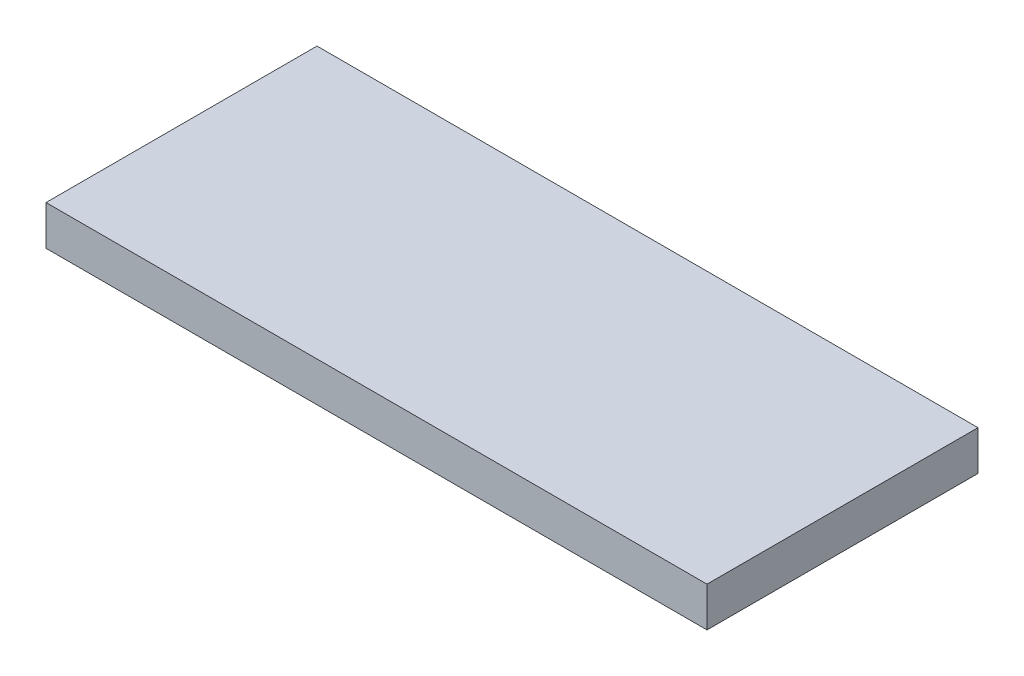
ISO-10303-21;
HEADER;
FILE_DESCRIPTION(('STEP AP214'),'2;1');
FILE_NAME('part.step','',(''),(''),'','','');
FILE_SCHEMA(('AUTOMOTIVE_DESIGN { 1 0 10303 214 1 1 1 1 }'));
ENDSEC;
DATA;
#1=APPLICATION_CONTEXT('core data for automotive mechanical design processes');
#2=APPLICATION_PROTOCOL_DEFINITION('international standard','automotive_design',2000,#1);
#3=PRODUCT_CONTEXT('',#1,'mechanical');
#4=PRODUCT('Part','Part','',(#3));
#5=PRODUCT_RELATED_PRODUCT_CATEGORY('part','',(#4));
#6=PRODUCT_DEFINITION_FORMATION('','',#4);
#7=PRODUCT_DEFINITION_CONTEXT('part definition',#1,'design');
#8=PRODUCT_DEFINITION('design','',#6,#7);
#9=PRODUCT_DEFINITION_SHAPE('','',#8);
#10=(LENGTH_UNIT() NAMED_UNIT(*) SI_UNIT(.MILLI.,.METRE.));
#11=(NAMED_UNIT(*) PLANE_ANGLE_UNIT() SI_UNIT($,.RADIAN.));
#12=(NAMED_UNIT(*) SI_UNIT($,.STERADIAN.) SOLID_ANGLE_UNIT());
#13=UNCERTAINTY_MEASURE_WITH_UNIT(LENGTH_MEASURE(1.E-05),#10,'distance_accuracy_value','');
#14=(GEOMETRIC_REPRESENTATION_CONTEXT(3) GLOBAL_UNCERTAINTY_ASSIGNED_CONTEXT((#13)) GLOBAL_UNIT_ASSIGNED_CONTEXT((#10,
#11,#12)) REPRESENTATION_CONTEXT('',''));
#15=CARTESIAN_POINT('',(0.,0.,0.));
#16=DIRECTION('',(0.,0.,1.));
#17=DIRECTION('',(1.,0.,0.));
#18=AXIS2_PLACEMENT_3D('',#15,#16,#17);
#19=CARTESIAN_POINT('',(-36.2857142857143,6.,-22.2142857142857));
#20=DIRECTION('',(1.,0.,0.));
#21=DIRECTION('',(0.,0.,-1.));
#22=AXIS2_PLACEMENT_3D('',#19,#20,#21);
#23=PLANE('',#22);
#24=DIRECTION('',(0.,0.,1.));
#25=VECTOR('',#24,1.);
#26=CARTESIAN_POINT('',(-36.2857142857143,0.,-22.2142857142857));
#27=LINE('',#26,#25);
#28=CARTESIAN_POINT('',(-36.2857142857143,0.,-22.2142857142857));
#29=VERTEX_POINT('',#28);
#30=CARTESIAN_POINT('',(-36.2857142857143,0.,18.7857142857143));
#31=VERTEX_POINT('',#30);
#32=EDGE_CURVE('E96',#29,#31,#27,.T.);
#33=ORIENTED_EDGE('',*,*,#32,.T.);
#34=DIRECTION('',(0.,-1.,0.));
#35=VECTOR('',#34,1.);
#36=CARTESIAN_POINT('',(-36.2857142857143,6.,18.7857142857143));
#37=LINE('',#36,#35);
#38=CARTESIAN_POINT('',(-36.2857142857143,6.,18.7857142857143));
#39=VERTEX_POINT('',#38);
#40=EDGE_CURVE('E11',#39,#31,#37,.T.);
#41=ORIENTED_EDGE('',*,*,#40,.F.);
#42=DIRECTION('',(0.,0.,1.));
#43=VECTOR('',#42,1.);
#44=CARTESIAN_POINT('',(-36.2857142857143,6.,-22.2142857142857));
#45=LINE('',#44,#43);
#46=CARTESIAN_POINT('',(-36.2857142857143,6.,-22.2142857142857));
#47=VERTEX_POINT('',#46);
#48=EDGE_CURVE('E84',#47,#39,#45,.T.);
#49=ORIENTED_EDGE('',*,*,#48,.F.);
#50=DIRECTION('',(0.,-1.,0.));
#51=VECTOR('',#50,1.);
#52=CARTESIAN_POINT('',(-36.2857142857143,6.,-22.2142857142857));
#53=LINE('',#52,#51);
#54=EDGE_CURVE('E92',#47,#29,#53,.T.);
#55=ORIENTED_EDGE('',*,*,#54,.T.);
#56=EDGE_LOOP('',(#33,#41,#49,#55));
#57=FACE_BOUND('',#56,.T.);
#58=ADVANCED_FACE('F33',(#57),#23,.F.);
#59=CARTESIAN_POINT('',(-36.2857142857143,6.,18.7857142857143));
#60=DIRECTION('',(0.,0.,-1.));
#61=DIRECTION('',(-1.,0.,0.));
#62=AXIS2_PLACEMENT_3D('',#59,#60,#61);
#63=PLANE('',#62);
#64=DIRECTION('',(1.,0.,0.));
#65=VECTOR('',#64,1.);
#66=CARTESIAN_POINT('',(-36.2857142857143,0.,18.7857142857143));
#67=LINE('',#66,#65);
#68=CARTESIAN_POINT('',(63.7142857142857,0.,18.7857142857143));
#69=VERTEX_POINT('',#68);
#70=EDGE_CURVE('E88',#31,#69,#67,.T.);
#71=ORIENTED_EDGE('',*,*,#70,.T.);
#72=DIRECTION('',(0.,-1.,0.));
#73=VECTOR('',#72,1.);
#74=CARTESIAN_POINT('',(63.7142857142857,6.,18.7857142857143));
#75=LINE('',#74,#73);
#76=CARTESIAN_POINT('',(63.7142857142857,6.,18.7857142857143));
#77=VERTEX_POINT('',#76);
#78=EDGE_CURVE('E41',#77,#69,#75,.T.);
#79=ORIENTED_EDGE('',*,*,#78,.F.);
#80=DIRECTION('',(1.,0.,0.));
#81=VECTOR('',#80,1.);
#82=CARTESIAN_POINT('',(-36.2857142857143,6.,18.7857142857143));
#83=LINE('',#82,#81);
#84=EDGE_CURVE('E79',#39,#77,#83,.T.);
#85=ORIENTED_EDGE('',*,*,#84,.F.);
#86=ORIENTED_EDGE('',*,*,#40,.T.);
#87=EDGE_LOOP('',(#71,#79,#85,#86));
#88=FACE_BOUND('',#87,.T.);
#89=ADVANCED_FACE('F87',(#88),#63,.F.);
#90=CARTESIAN_POINT('',(63.7142857142857,6.,-22.2142857142857));
#91=DIRECTION('',(-1.,0.,0.));
#92=DIRECTION('',(0.,0.,1.));
#93=AXIS2_PLACEMENT_3D('',#90,#91,#92);
#94=PLANE('',#93);
#95=DIRECTION('',(0.,0.,-1.));
#96=VECTOR('',#95,1.);
#97=CARTESIAN_POINT('',(63.7142857142857,0.,-22.2142857142857));
#98=LINE('',#97,#96);
#99=CARTESIAN_POINT('',(63.7142857142857,0.,-22.2142857142857));
#100=VERTEX_POINT('',#99);
#101=EDGE_CURVE('E66',#69,#100,#98,.T.);
#102=ORIENTED_EDGE('',*,*,#101,.T.);
#103=DIRECTION('',(0.,-1.,0.));
#104=VECTOR('',#103,1.);
#105=CARTESIAN_POINT('',(63.7142857142857,6.,-22.2142857142857));
#106=LINE('',#105,#104);
#107=CARTESIAN_POINT('',(63.7142857142857,6.,-22.2142857142857));
#108=VERTEX_POINT('',#107);
#109=EDGE_CURVE('E89',#108,#100,#106,.T.);
#110=ORIENTED_EDGE('',*,*,#109,.F.);
#111=DIRECTION('',(0.,0.,-1.));
#112=VECTOR('',#111,1.);
#113=CARTESIAN_POINT('',(63.7142857142857,6.,-22.2142857142857));
#114=LINE('',#113,#112);
#115=EDGE_CURVE('E82',#77,#108,#114,.T.);
#116=ORIENTED_EDGE('',*,*,#115,.F.);
#117=ORIENTED_EDGE('',*,*,#78,.T.);
#118=EDGE_LOOP('',(#102,#110,#116,#117));
#119=FACE_BOUND('',#118,.T.);
#120=ADVANCED_FACE('F90',(#119),#94,.F.);
#121=CARTESIAN_POINT('',(-36.2857142857143,6.,-22.2142857142857));
#122=DIRECTION('',(0.,0.,1.));
#123=DIRECTION('',(1.,0.,0.));
#124=AXIS2_PLACEMENT_3D('',#121,#122,#123);
#125=PLANE('',#124);
#126=DIRECTION('',(-1.,0.,0.));
#127=VECTOR('',#126,1.);
#128=CARTESIAN_POINT('',(-36.2857142857143,0.,-22.2142857142857));
#129=LINE('',#128,#127);
#130=EDGE_CURVE('E72',#100,#29,#129,.T.);
#131=ORIENTED_EDGE('',*,*,#130,.T.);
#132=ORIENTED_EDGE('',*,*,#54,.F.);
#133=DIRECTION('',(-1.,0.,0.));
#134=VECTOR('',#133,1.);
#135=CARTESIAN_POINT('',(-36.2857142857143,6.,-22.2142857142857));
#136=LINE('',#135,#134);
#137=EDGE_CURVE('E49',#108,#47,#136,.T.);
#138=ORIENTED_EDGE('',*,*,#137,.F.);
#139=ORIENTED_EDGE('',*,*,#109,.T.);
#140=EDGE_LOOP('',(#131,#132,#138,#139));
#141=FACE_BOUND('',#140,.T.);
#142=ADVANCED_FACE('F103',(#141),#125,.F.);
#143=CARTESIAN_POINT('',(0.,6.,0.));
#144=DIRECTION('',(0.,1.,0.));
#145=DIRECTION('',(0.,0.,1.));
#146=AXIS2_PLACEMENT_3D('',#143,#144,#145);
#147=PLANE('',#146);
#148=ORIENTED_EDGE('',*,*,#48,.T.);
#149=ORIENTED_EDGE('',*,*,#84,.T.);
#150=ORIENTED_EDGE('',*,*,#115,.T.);
#151=ORIENTED_EDGE('',*,*,#137,.T.);
#152=EDGE_LOOP('',(#148,#149,#150,#151));
#153=FACE_BOUND('',#152,.T.);
#154=ADVANCED_FACE('F80',(#153),#147,.T.);
#155=CARTESIAN_POINT('',(0.,0.,0.));
#156=DIRECTION('',(0.,1.,0.));
#157=DIRECTION('',(0.,0.,1.));
#158=AXIS2_PLACEMENT_3D('',#155,#156,#157);
#159=PLANE('',#158);
#160=ORIENTED_EDGE('',*,*,#32,.F.);
#161=ORIENTED_EDGE('',*,*,#130,.F.);
#162=ORIENTED_EDGE('',*,*,#101,.F.);
#163=ORIENTED_EDGE('',*,*,#70,.F.);
#164=EDGE_LOOP('',(#160,#161,#162,#163));
#165=FACE_BOUND('',#164,.T.);
#166=ADVANCED_FACE('F106',(#165),#159,.F.);
#167=CLOSED_SHELL('',(#58,#89,#120,#142,#154,#166));
#168=MANIFOLD_SOLID_BREP('B2',#167);
#169=ADVANCED_BREP_SHAPE_REPRESENTATION('',(#18,#168),#14);
#170=SHAPE_DEFINITION_REPRESENTATION(#9,#169);
ENDSEC;
END-ISO-10303-21;
